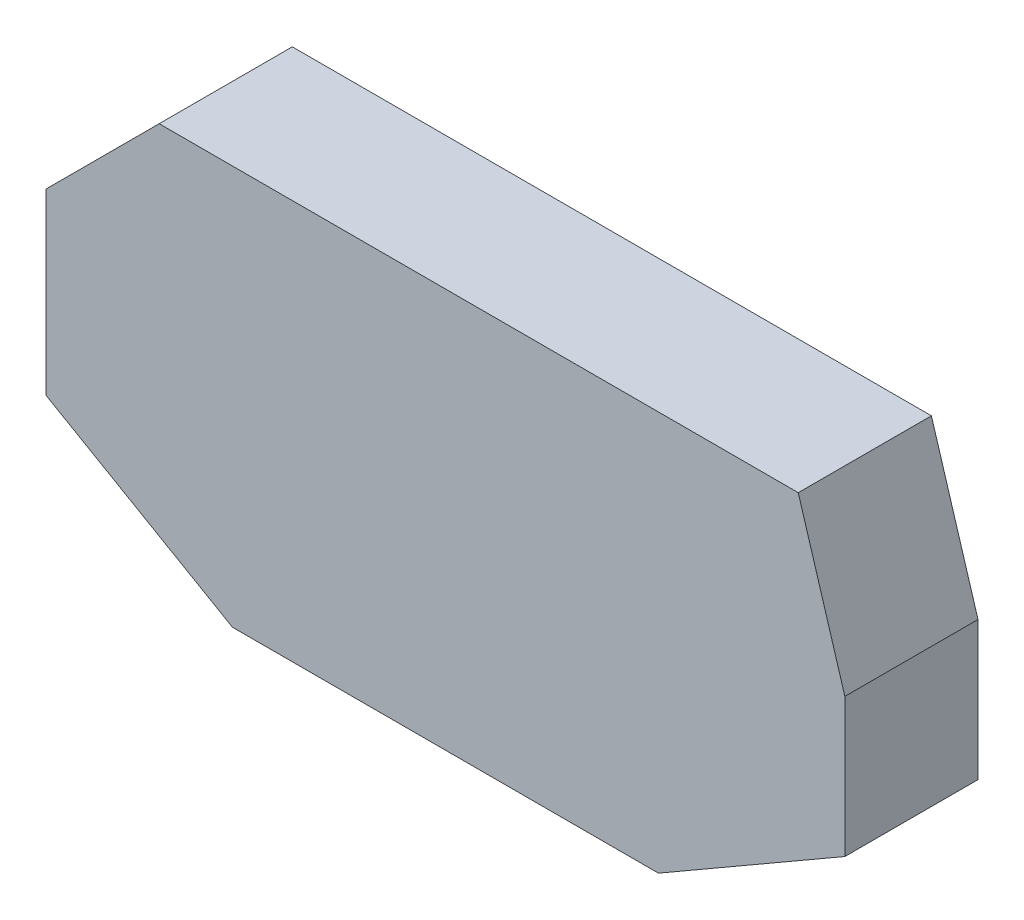
ISO-10303-21;
HEADER;
FILE_DESCRIPTION(('STEP AP214'),'2;1');
FILE_NAME('part.step','',(''),(''),'','','');
FILE_SCHEMA(('AUTOMOTIVE_DESIGN { 1 0 10303 214 1 1 1 1 }'));
ENDSEC;
DATA;
#1=APPLICATION_CONTEXT('core data for automotive mechanical design processes');
#2=APPLICATION_PROTOCOL_DEFINITION('international standard','automotive_design',2000,#1);
#3=PRODUCT_CONTEXT('',#1,'mechanical');
#4=PRODUCT('Part','Part','',(#3));
#5=PRODUCT_RELATED_PRODUCT_CATEGORY('part','',(#4));
#6=PRODUCT_DEFINITION_FORMATION('','',#4);
#7=PRODUCT_DEFINITION_CONTEXT('part definition',#1,'design');
#8=PRODUCT_DEFINITION('design','',#6,#7);
#9=PRODUCT_DEFINITION_SHAPE('','',#8);
#10=(LENGTH_UNIT() NAMED_UNIT(*) SI_UNIT(.MILLI.,.METRE.));
#11=(NAMED_UNIT(*) PLANE_ANGLE_UNIT() SI_UNIT($,.RADIAN.));
#12=(NAMED_UNIT(*) SI_UNIT($,.STERADIAN.) SOLID_ANGLE_UNIT());
#13=UNCERTAINTY_MEASURE_WITH_UNIT(LENGTH_MEASURE(1.E-05),#10,'distance_accuracy_value','');
#14=(GEOMETRIC_REPRESENTATION_CONTEXT(3) GLOBAL_UNCERTAINTY_ASSIGNED_CONTEXT((#13)) GLOBAL_UNIT_ASSIGNED_CONTEXT((#10,
#11,#12)) REPRESENTATION_CONTEXT('',''));
#15=CARTESIAN_POINT('',(0.,0.,0.));
#16=DIRECTION('',(0.,0.,1.));
#17=DIRECTION('',(1.,0.,0.));
#18=AXIS2_PLACEMENT_3D('',#15,#16,#17);
#19=CARTESIAN_POINT('',(-60.,-13.8341924626905,20.));
#20=DIRECTION('',(1.,0.,0.));
#21=DIRECTION('',(0.,0.,-1.));
#22=AXIS2_PLACEMENT_3D('',#19,#20,#21);
#23=PLANE('',#22);
#24=DIRECTION('',(0.,-1.,0.));
#25=VECTOR('',#24,1.);
#26=CARTESIAN_POINT('',(-60.,-13.8341924626905,0.));
#27=LINE('',#26,#25);
#28=CARTESIAN_POINT('',(-60.,13.,0.));
#29=VERTEX_POINT('',#28);
#30=CARTESIAN_POINT('',(-60.,-13.8341924626905,0.));
#31=VERTEX_POINT('',#30);
#32=EDGE_CURVE('E129',#29,#31,#27,.T.);
#33=ORIENTED_EDGE('',*,*,#32,.T.);
#34=DIRECTION('',(0.,0.,-1.));
#35=VECTOR('',#34,1.);
#36=CARTESIAN_POINT('',(-60.,-13.8341924626905,20.));
#37=LINE('',#36,#35);
#38=CARTESIAN_POINT('',(-60.,-13.8341924626905,20.));
#39=VERTEX_POINT('',#38);
#40=EDGE_CURVE('E11',#39,#31,#37,.T.);
#41=ORIENTED_EDGE('',*,*,#40,.F.);
#42=DIRECTION('',(0.,-1.,0.));
#43=VECTOR('',#42,1.);
#44=CARTESIAN_POINT('',(-60.,-13.8341924626905,20.));
#45=LINE('',#44,#43);
#46=CARTESIAN_POINT('',(-60.,13.,20.));
#47=VERTEX_POINT('',#46);
#48=EDGE_CURVE('E143',#47,#39,#45,.T.);
#49=ORIENTED_EDGE('',*,*,#48,.F.);
#50=DIRECTION('',(0.,0.,-1.));
#51=VECTOR('',#50,1.);
#52=CARTESIAN_POINT('',(-60.,13.,20.));
#53=LINE('',#52,#51);
#54=EDGE_CURVE('E125',#47,#29,#53,.T.);
#55=ORIENTED_EDGE('',*,*,#54,.T.);
#56=EDGE_LOOP('',(#33,#41,#49,#55));
#57=FACE_BOUND('',#56,.T.);
#58=ADVANCED_FACE('F33',(#57),#23,.F.);
#59=CARTESIAN_POINT('',(-60.,-13.8341924626905,20.));
#60=DIRECTION('',(0.5,0.866025403784439,0.));
#61=DIRECTION('',(-0.866025403784439,0.5,0.));
#62=AXIS2_PLACEMENT_3D('',#59,#60,#61);
#63=PLANE('',#62);
#64=DIRECTION('',(0.866025403784439,-0.499999999999999,0.));
#65=VECTOR('',#64,1.);
#66=CARTESIAN_POINT('',(-60.,-13.8341924626905,0.));
#67=LINE('',#66,#65);
#68=CARTESIAN_POINT('',(-32.,-30.,0.));
#69=VERTEX_POINT('',#68);
#70=EDGE_CURVE('E132',#31,#69,#67,.T.);
#71=ORIENTED_EDGE('',*,*,#70,.T.);
#72=DIRECTION('',(0.,0.,-1.));
#73=VECTOR('',#72,1.);
#74=CARTESIAN_POINT('',(-32.,-30.,20.));
#75=LINE('',#74,#73);
#76=CARTESIAN_POINT('',(-32.,-30.,20.));
#77=VERTEX_POINT('',#76);
#78=EDGE_CURVE('E41',#77,#69,#75,.T.);
#79=ORIENTED_EDGE('',*,*,#78,.F.);
#80=DIRECTION('',(0.866025403784439,-0.499999999999999,0.));
#81=VECTOR('',#80,1.);
#82=CARTESIAN_POINT('',(-60.,-13.8341924626905,20.));
#83=LINE('',#82,#81);
#84=EDGE_CURVE('E92',#39,#77,#83,.T.);
#85=ORIENTED_EDGE('',*,*,#84,.F.);
#86=ORIENTED_EDGE('',*,*,#40,.T.);
#87=EDGE_LOOP('',(#71,#79,#85,#86));
#88=FACE_BOUND('',#87,.T.);
#89=ADVANCED_FACE('F178',(#88),#63,.F.);
#90=CARTESIAN_POINT('',(-32.,-30.,20.));
#91=DIRECTION('',(0.,1.,0.));
#92=DIRECTION('',(0.,0.,1.));
#93=AXIS2_PLACEMENT_3D('',#90,#91,#92);
#94=PLANE('',#93);
#95=DIRECTION('',(1.,0.,0.));
#96=VECTOR('',#95,1.);
#97=CARTESIAN_POINT('',(-32.,-30.,0.));
#98=LINE('',#97,#96);
#99=CARTESIAN_POINT('',(32.,-30.,0.));
#100=VERTEX_POINT('',#99);
#101=EDGE_CURVE('E134',#69,#100,#98,.T.);
#102=ORIENTED_EDGE('',*,*,#101,.T.);
#103=DIRECTION('',(0.,0.,-1.));
#104=VECTOR('',#103,1.);
#105=CARTESIAN_POINT('',(32.,-30.,20.));
#106=LINE('',#105,#104);
#107=CARTESIAN_POINT('',(32.,-30.,20.));
#108=VERTEX_POINT('',#107);
#109=EDGE_CURVE('E150',#108,#100,#106,.T.);
#110=ORIENTED_EDGE('',*,*,#109,.F.);
#111=DIRECTION('',(1.,0.,0.));
#112=VECTOR('',#111,1.);
#113=CARTESIAN_POINT('',(-32.,-30.,20.));
#114=LINE('',#113,#112);
#115=EDGE_CURVE('E158',#77,#108,#114,.T.);
#116=ORIENTED_EDGE('',*,*,#115,.F.);
#117=ORIENTED_EDGE('',*,*,#78,.T.);
#118=EDGE_LOOP('',(#102,#110,#116,#117));
#119=FACE_BOUND('',#118,.T.);
#120=ADVANCED_FACE('F156',(#119),#94,.F.);
#121=CARTESIAN_POINT('',(32.,-30.,20.));
#122=DIRECTION('',(-0.5,0.866025403784439,0.));
#123=DIRECTION('',(-0.866025403784439,-0.5,0.));
#124=AXIS2_PLACEMENT_3D('',#121,#122,#123);
#125=PLANE('',#124);
#126=DIRECTION('',(0.866025403784439,0.499999999999999,0.));
#127=VECTOR('',#126,1.);
#128=CARTESIAN_POINT('',(32.,-30.,0.));
#129=LINE('',#128,#127);
#130=CARTESIAN_POINT('',(60.,-13.8341924626905,0.));
#131=VERTEX_POINT('',#130);
#132=EDGE_CURVE('E136',#100,#131,#129,.T.);
#133=ORIENTED_EDGE('',*,*,#132,.T.);
#134=DIRECTION('',(0.,0.,-1.));
#135=VECTOR('',#134,1.);
#136=CARTESIAN_POINT('',(60.,-13.8341924626905,20.));
#137=LINE('',#136,#135);
#138=CARTESIAN_POINT('',(60.,-13.8341924626905,20.));
#139=VERTEX_POINT('',#138);
#140=EDGE_CURVE('E147',#139,#131,#137,.T.);
#141=ORIENTED_EDGE('',*,*,#140,.F.);
#142=DIRECTION('',(0.866025403784439,0.499999999999999,0.));
#143=VECTOR('',#142,1.);
#144=CARTESIAN_POINT('',(32.,-30.,20.));
#145=LINE('',#144,#143);
#146=EDGE_CURVE('E170',#108,#139,#145,.T.);
#147=ORIENTED_EDGE('',*,*,#146,.F.);
#148=ORIENTED_EDGE('',*,*,#109,.T.);
#149=EDGE_LOOP('',(#133,#141,#147,#148));
#150=FACE_BOUND('',#149,.T.);
#151=ADVANCED_FACE('F166',(#150),#125,.F.);
#152=CARTESIAN_POINT('',(60.,-13.8341924626905,20.));
#153=DIRECTION('',(-1.,0.,0.));
#154=DIRECTION('',(0.,-1.,0.));
#155=AXIS2_PLACEMENT_3D('',#152,#153,#154);
#156=PLANE('',#155);
#157=DIRECTION('',(0.,1.,0.));
#158=VECTOR('',#157,1.);
#159=CARTESIAN_POINT('',(60.,-13.8341924626905,0.));
#160=LINE('',#159,#158);
#161=CARTESIAN_POINT('',(60.,7.,0.));
#162=VERTEX_POINT('',#161);
#163=EDGE_CURVE('E138',#131,#162,#160,.T.);
#164=ORIENTED_EDGE('',*,*,#163,.T.);
#165=DIRECTION('',(0.,0.,-1.));
#166=VECTOR('',#165,1.);
#167=CARTESIAN_POINT('',(60.,7.,20.));
#168=LINE('',#167,#166);
#169=CARTESIAN_POINT('',(60.,7.,20.));
#170=VERTEX_POINT('',#169);
#171=EDGE_CURVE('E120',#170,#162,#168,.T.);
#172=ORIENTED_EDGE('',*,*,#171,.F.);
#173=DIRECTION('',(0.,1.,0.));
#174=VECTOR('',#173,1.);
#175=CARTESIAN_POINT('',(60.,-13.8341924626905,20.));
#176=LINE('',#175,#174);
#177=EDGE_CURVE('E111',#139,#170,#176,.T.);
#178=ORIENTED_EDGE('',*,*,#177,.F.);
#179=ORIENTED_EDGE('',*,*,#140,.T.);
#180=EDGE_LOOP('',(#164,#172,#178,#179));
#181=FACE_BOUND('',#180,.T.);
#182=ADVANCED_FACE('F169',(#181),#156,.F.);
#183=CARTESIAN_POINT('',(60.,7.,20.));
#184=DIRECTION('',(-0.956673880428859,-0.291161615782696,0.));
#185=DIRECTION('',(0.291161615782696,-0.956673880428858,0.));
#186=AXIS2_PLACEMENT_3D('',#183,#184,#185);
#187=PLANE('',#186);
#188=DIRECTION('',(-0.291161615782696,0.956673880428858,0.));
#189=VECTOR('',#188,1.);
#190=CARTESIAN_POINT('',(60.,7.,0.));
#191=LINE('',#190,#189);
#192=CARTESIAN_POINT('',(53.,30.,0.));
#193=VERTEX_POINT('',#192);
#194=EDGE_CURVE('E119',#162,#193,#191,.T.);
#195=ORIENTED_EDGE('',*,*,#194,.T.);
#196=DIRECTION('',(0.,0.,-1.));
#197=VECTOR('',#196,1.);
#198=CARTESIAN_POINT('',(53.,30.,20.));
#199=LINE('',#198,#197);
#200=CARTESIAN_POINT('',(53.,30.,20.));
#201=VERTEX_POINT('',#200);
#202=EDGE_CURVE('E116',#201,#193,#199,.T.);
#203=ORIENTED_EDGE('',*,*,#202,.F.);
#204=DIRECTION('',(-0.291161615782696,0.956673880428858,0.));
#205=VECTOR('',#204,1.);
#206=CARTESIAN_POINT('',(60.,7.,20.));
#207=LINE('',#206,#205);
#208=EDGE_CURVE('E105',#170,#201,#207,.T.);
#209=ORIENTED_EDGE('',*,*,#208,.F.);
#210=ORIENTED_EDGE('',*,*,#171,.T.);
#211=EDGE_LOOP('',(#195,#203,#209,#210));
#212=FACE_BOUND('',#211,.T.);
#213=ADVANCED_FACE('F117',(#212),#187,.F.);
#214=CARTESIAN_POINT('',(-43.,30.,20.));
#215=DIRECTION('',(0.,-1.,0.));
#216=DIRECTION('',(0.,0.,-1.));
#217=AXIS2_PLACEMENT_3D('',#214,#215,#216);
#218=PLANE('',#217);
#219=DIRECTION('',(-1.,0.,0.));
#220=VECTOR('',#219,1.);
#221=CARTESIAN_POINT('',(-43.,30.,0.));
#222=LINE('',#221,#220);
#223=CARTESIAN_POINT('',(-43.,30.,0.));
#224=VERTEX_POINT('',#223);
#225=EDGE_CURVE('E78',#193,#224,#222,.T.);
#226=ORIENTED_EDGE('',*,*,#225,.T.);
#227=DIRECTION('',(0.,0.,-1.));
#228=VECTOR('',#227,1.);
#229=CARTESIAN_POINT('',(-43.,30.,20.));
#230=LINE('',#229,#228);
#231=CARTESIAN_POINT('',(-43.,30.,20.));
#232=VERTEX_POINT('',#231);
#233=EDGE_CURVE('E121',#232,#224,#230,.T.);
#234=ORIENTED_EDGE('',*,*,#233,.F.);
#235=DIRECTION('',(-1.,0.,0.));
#236=VECTOR('',#235,1.);
#237=CARTESIAN_POINT('',(-43.,30.,20.));
#238=LINE('',#237,#236);
#239=EDGE_CURVE('E109',#201,#232,#238,.T.);
#240=ORIENTED_EDGE('',*,*,#239,.F.);
#241=ORIENTED_EDGE('',*,*,#202,.T.);
#242=EDGE_LOOP('',(#226,#234,#240,#241));
#243=FACE_BOUND('',#242,.T.);
#244=ADVANCED_FACE('F123',(#243),#218,.F.);
#245=CARTESIAN_POINT('',(-60.,13.,20.));
#246=DIRECTION('',(0.707106781186548,-0.707106781186548,0.));
#247=DIRECTION('',(0.707106781186548,0.707106781186548,0.));
#248=AXIS2_PLACEMENT_3D('',#245,#246,#247);
#249=PLANE('',#248);
#250=DIRECTION('',(-0.707106781186547,-0.707106781186547,0.));
#251=VECTOR('',#250,1.);
#252=CARTESIAN_POINT('',(-60.,13.,0.));
#253=LINE('',#252,#251);
#254=EDGE_CURVE('E84',#224,#29,#253,.T.);
#255=ORIENTED_EDGE('',*,*,#254,.T.);
#256=ORIENTED_EDGE('',*,*,#54,.F.);
#257=DIRECTION('',(-0.707106781186547,-0.707106781186547,0.));
#258=VECTOR('',#257,1.);
#259=CARTESIAN_POINT('',(-60.,13.,20.));
#260=LINE('',#259,#258);
#261=EDGE_CURVE('E49',#232,#47,#260,.T.);
#262=ORIENTED_EDGE('',*,*,#261,.F.);
#263=ORIENTED_EDGE('',*,*,#233,.T.);
#264=EDGE_LOOP('',(#255,#256,#262,#263));
#265=FACE_BOUND('',#264,.T.);
#266=ADVANCED_FACE('F194',(#265),#249,.F.);
#267=CARTESIAN_POINT('',(0.,0.,20.));
#268=DIRECTION('',(0.,0.,-1.));
#269=DIRECTION('',(-1.,0.,0.));
#270=AXIS2_PLACEMENT_3D('',#267,#268,#269);
#271=PLANE('',#270);
#272=ORIENTED_EDGE('',*,*,#48,.T.);
#273=ORIENTED_EDGE('',*,*,#84,.T.);
#274=ORIENTED_EDGE('',*,*,#115,.T.);
#275=ORIENTED_EDGE('',*,*,#146,.T.);
#276=ORIENTED_EDGE('',*,*,#177,.T.);
#277=ORIENTED_EDGE('',*,*,#208,.T.);
#278=ORIENTED_EDGE('',*,*,#239,.T.);
#279=ORIENTED_EDGE('',*,*,#261,.T.);
#280=EDGE_LOOP('',(#272,#273,#274,#275,#276,#277,#278,#279));
#281=FACE_BOUND('',#280,.T.);
#282=ADVANCED_FACE('F107',(#281),#271,.F.);
#283=CARTESIAN_POINT('',(0.,0.,0.));
#284=DIRECTION('',(0.,0.,-1.));
#285=DIRECTION('',(-1.,0.,0.));
#286=AXIS2_PLACEMENT_3D('',#283,#284,#285);
#287=PLANE('',#286);
#288=ORIENTED_EDGE('',*,*,#32,.F.);
#289=ORIENTED_EDGE('',*,*,#254,.F.);
#290=ORIENTED_EDGE('',*,*,#225,.F.);
#291=ORIENTED_EDGE('',*,*,#194,.F.);
#292=ORIENTED_EDGE('',*,*,#163,.F.);
#293=ORIENTED_EDGE('',*,*,#132,.F.);
#294=ORIENTED_EDGE('',*,*,#101,.F.);
#295=ORIENTED_EDGE('',*,*,#70,.F.);
#296=EDGE_LOOP('',(#288,#289,#290,#291,#292,#293,#294,#295));
#297=FACE_BOUND('',#296,.T.);
#298=ADVANCED_FACE('F162',(#297),#287,.T.);
#299=CLOSED_SHELL('',(#58,#89,#120,#151,#182,#213,#244,#266,#282,#298));
#300=MANIFOLD_SOLID_BREP('B2',#299);
#301=ADVANCED_BREP_SHAPE_REPRESENTATION('',(#18,#300),#14);
#302=SHAPE_DEFINITION_REPRESENTATION(#9,#301);
ENDSEC;
END-ISO-10303-21;
